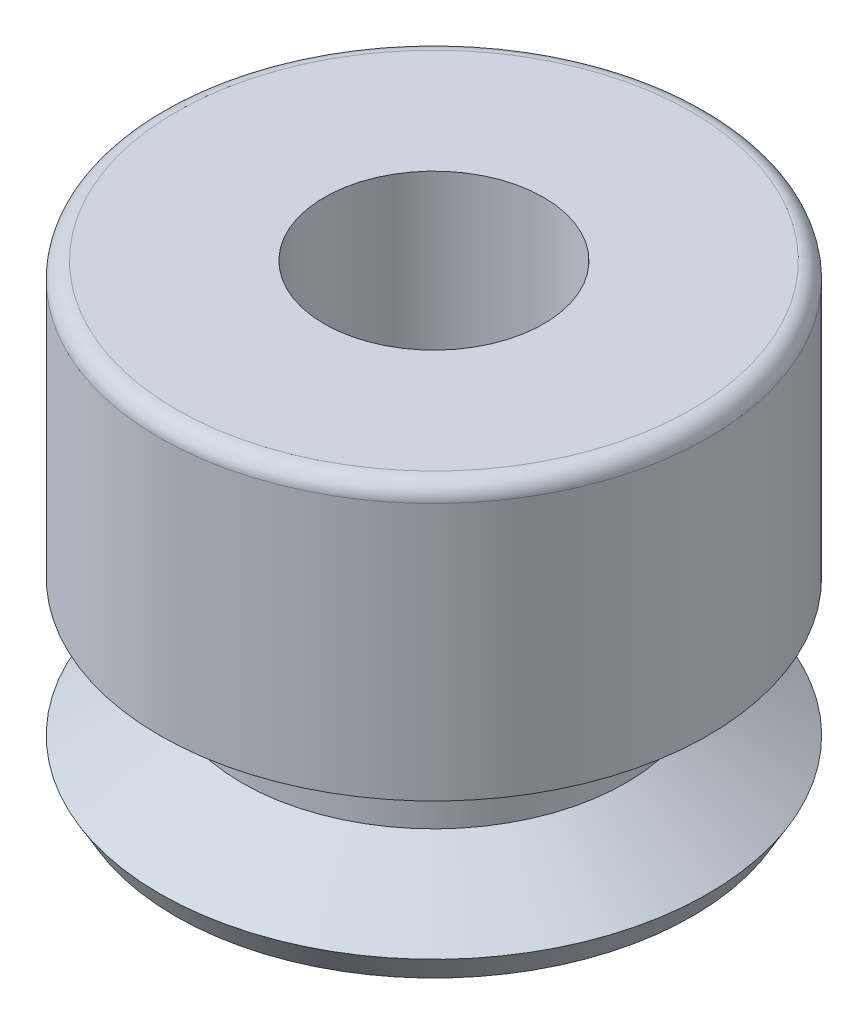
ISO-10303-21;
HEADER;
FILE_DESCRIPTION(('STEP AP214'),'2;1');
FILE_NAME('part.step','',(''),(''),'','','');
FILE_SCHEMA(('AUTOMOTIVE_DESIGN { 1 0 10303 214 1 1 1 1 }'));
ENDSEC;
DATA;
#1=APPLICATION_CONTEXT('core data for automotive mechanical design processes');
#2=APPLICATION_PROTOCOL_DEFINITION('international standard','automotive_design',2000,#1);
#3=PRODUCT_CONTEXT('',#1,'mechanical');
#4=PRODUCT('Part','Part','',(#3));
#5=PRODUCT_RELATED_PRODUCT_CATEGORY('part','',(#4));
#6=PRODUCT_DEFINITION_FORMATION('','',#4);
#7=PRODUCT_DEFINITION_CONTEXT('part definition',#1,'design');
#8=PRODUCT_DEFINITION('design','',#6,#7);
#9=PRODUCT_DEFINITION_SHAPE('','',#8);
#10=(LENGTH_UNIT() NAMED_UNIT(*) SI_UNIT(.MILLI.,.METRE.));
#11=(NAMED_UNIT(*) PLANE_ANGLE_UNIT() SI_UNIT($,.RADIAN.));
#12=(NAMED_UNIT(*) SI_UNIT($,.STERADIAN.) SOLID_ANGLE_UNIT());
#13=UNCERTAINTY_MEASURE_WITH_UNIT(LENGTH_MEASURE(1.E-05),#10,'distance_accuracy_value','');
#14=(GEOMETRIC_REPRESENTATION_CONTEXT(3) GLOBAL_UNCERTAINTY_ASSIGNED_CONTEXT((#13)) GLOBAL_UNIT_ASSIGNED_CONTEXT((#10,
#11,#12)) REPRESENTATION_CONTEXT('',''));
#15=CARTESIAN_POINT('',(0.,0.,0.));
#16=DIRECTION('',(0.,0.,1.));
#17=DIRECTION('',(1.,0.,0.));
#18=AXIS2_PLACEMENT_3D('',#15,#16,#17);
#19=CARTESIAN_POINT('',(0.,8.,0.));
#20=DIRECTION('',(0.,-1.,0.));
#21=DIRECTION('',(0.,0.,-1.));
#22=AXIS2_PLACEMENT_3D('',#19,#20,#21);
#23=PLANE('',#22);
#24=CARTESIAN_POINT('',(0.,8.,0.));
#25=DIRECTION('',(0.,1.,0.));
#26=DIRECTION('',(0.,0.,1.));
#27=AXIS2_PLACEMENT_3D('',#24,#25,#26);
#28=CIRCLE('',#27,4.7);
#29=CARTESIAN_POINT('',(0.,8.,4.7));
#30=VERTEX_POINT('',#29);
#31=EDGE_CURVE('E10',#30,#30,#28,.T.);
#32=ORIENTED_EDGE('',*,*,#31,.T.);
#33=EDGE_LOOP('',(#32));
#34=FACE_BOUND('',#33,.T.);
#35=CARTESIAN_POINT('',(0.,8.,0.));
#36=DIRECTION('',(0.,1.,0.));
#37=DIRECTION('',(0.,0.,1.));
#38=AXIS2_PLACEMENT_3D('',#35,#36,#37);
#39=CIRCLE('',#38,2.);
#40=CARTESIAN_POINT('',(0.,8.,2.));
#41=VERTEX_POINT('',#40);
#42=EDGE_CURVE('E62',#41,#41,#39,.T.);
#43=ORIENTED_EDGE('',*,*,#42,.F.);
#44=EDGE_LOOP('',(#43));
#45=FACE_BOUND('',#44,.T.);
#46=ADVANCED_FACE('F37',(#34,#45),#23,.F.);
#47=CARTESIAN_POINT('',(0.,7.70000000000012,0.));
#48=DIRECTION('',(0.,1.,0.));
#49=DIRECTION('',(0.,0.,1.));
#50=AXIS2_PLACEMENT_3D('',#47,#48,#49);
#51=TOROIDAL_SURFACE('',#50,4.70000000000012,0.299999999999882);
#52=ORIENTED_EDGE('',*,*,#31,.F.);
#53=EDGE_LOOP('',(#52));
#54=FACE_BOUND('',#53,.T.);
#55=CARTESIAN_POINT('',(0.,7.7,0.));
#56=DIRECTION('',(0.,1.,0.));
#57=DIRECTION('',(0.,0.,1.));
#58=AXIS2_PLACEMENT_3D('',#55,#56,#57);
#59=CIRCLE('',#58,5.);
#60=CARTESIAN_POINT('',(0.,7.7,5.));
#61=VERTEX_POINT('',#60);
#62=EDGE_CURVE('E43',#61,#61,#59,.T.);
#63=ORIENTED_EDGE('',*,*,#62,.T.);
#64=EDGE_LOOP('',(#63));
#65=FACE_BOUND('',#64,.T.);
#66=ADVANCED_FACE('F92',(#54,#65),#51,.T.);
#67=CARTESIAN_POINT('',(0.,0.,0.));
#68=DIRECTION('',(0.,1.,0.));
#69=DIRECTION('',(0.,0.,1.));
#70=AXIS2_PLACEMENT_3D('',#67,#68,#69);
#71=CYLINDRICAL_SURFACE('',#70,5.);
#72=ORIENTED_EDGE('',*,*,#62,.F.);
#73=EDGE_LOOP('',(#72));
#74=FACE_BOUND('',#73,.T.);
#75=CARTESIAN_POINT('',(0.,3.,0.));
#76=DIRECTION('',(0.,1.,0.));
#77=DIRECTION('',(0.,0.,1.));
#78=AXIS2_PLACEMENT_3D('',#75,#76,#77);
#79=CIRCLE('',#78,5.);
#80=CARTESIAN_POINT('',(0.,3.,5.));
#81=VERTEX_POINT('',#80);
#82=EDGE_CURVE('E47',#81,#81,#79,.T.);
#83=ORIENTED_EDGE('',*,*,#82,.T.);
#84=EDGE_LOOP('',(#83));
#85=FACE_BOUND('',#84,.T.);
#86=ADVANCED_FACE('F98',(#74,#85),#71,.T.);
#87=CARTESIAN_POINT('',(0.,2.,0.));
#88=DIRECTION('',(0.,1.,0.));
#89=DIRECTION('',(0.,0.,1.));
#90=AXIS2_PLACEMENT_3D('',#87,#88,#89);
#91=CONICAL_SURFACE('',#90,3.5,0.982793723247329);
#92=ORIENTED_EDGE('',*,*,#82,.F.);
#93=EDGE_LOOP('',(#92));
#94=FACE_BOUND('',#93,.T.);
#95=CARTESIAN_POINT('',(0.,2.,0.));
#96=DIRECTION('',(0.,1.,0.));
#97=DIRECTION('',(0.,0.,1.));
#98=AXIS2_PLACEMENT_3D('',#95,#96,#97);
#99=CIRCLE('',#98,3.5);
#100=CARTESIAN_POINT('',(0.,2.,3.5));
#101=VERTEX_POINT('',#100);
#102=EDGE_CURVE('E51',#101,#101,#99,.T.);
#103=ORIENTED_EDGE('',*,*,#102,.T.);
#104=EDGE_LOOP('',(#103));
#105=FACE_BOUND('',#104,.T.);
#106=ADVANCED_FACE('F126',(#94,#105),#91,.T.);
#107=CARTESIAN_POINT('',(0.,0.,0.));
#108=DIRECTION('',(0.,1.,0.));
#109=DIRECTION('',(0.,0.,1.));
#110=AXIS2_PLACEMENT_3D('',#107,#108,#109);
#111=CYLINDRICAL_SURFACE('',#110,3.5);
#112=ORIENTED_EDGE('',*,*,#102,.F.);
#113=EDGE_LOOP('',(#112));
#114=FACE_BOUND('',#113,.T.);
#115=CARTESIAN_POINT('',(0.,1.5,0.));
#116=DIRECTION('',(0.,1.,0.));
#117=DIRECTION('',(0.,0.,1.));
#118=AXIS2_PLACEMENT_3D('',#115,#116,#117);
#119=CIRCLE('',#118,3.5);
#120=CARTESIAN_POINT('',(0.,1.5,3.5));
#121=VERTEX_POINT('',#120);
#122=EDGE_CURVE('E56',#121,#121,#119,.T.);
#123=ORIENTED_EDGE('',*,*,#122,.T.);
#124=EDGE_LOOP('',(#123));
#125=FACE_BOUND('',#124,.T.);
#126=ADVANCED_FACE('F122',(#114,#125),#111,.T.);
#127=CARTESIAN_POINT('',(0.,0.5,0.));
#128=DIRECTION('',(0.,-1.,0.));
#129=DIRECTION('',(0.,0.,-1.));
#130=AXIS2_PLACEMENT_3D('',#127,#128,#129);
#131=CONICAL_SURFACE('',#130,5.,0.982793723247329);
#132=ORIENTED_EDGE('',*,*,#122,.F.);
#133=EDGE_LOOP('',(#132));
#134=FACE_BOUND('',#133,.T.);
#135=CARTESIAN_POINT('',(0.,0.5,0.));
#136=DIRECTION('',(0.,1.,0.));
#137=DIRECTION('',(0.,0.,1.));
#138=AXIS2_PLACEMENT_3D('',#135,#136,#137);
#139=CIRCLE('',#138,5.);
#140=CARTESIAN_POINT('',(0.,0.5,5.));
#141=VERTEX_POINT('',#140);
#142=EDGE_CURVE('E59',#141,#141,#139,.T.);
#143=ORIENTED_EDGE('',*,*,#142,.T.);
#144=EDGE_LOOP('',(#143));
#145=FACE_BOUND('',#144,.T.);
#146=ADVANCED_FACE('F118',(#134,#145),#131,.T.);
#147=CARTESIAN_POINT('',(0.,0.,0.));
#148=DIRECTION('',(0.,1.,0.));
#149=DIRECTION('',(0.,0.,1.));
#150=AXIS2_PLACEMENT_3D('',#147,#148,#149);
#151=CONICAL_SURFACE('',#150,4.7113248654052,0.52359877559828);
#152=ORIENTED_EDGE('',*,*,#142,.F.);
#153=EDGE_LOOP('',(#152));
#154=FACE_BOUND('',#153,.T.);
#155=CARTESIAN_POINT('',(0.,0.,0.));
#156=DIRECTION('',(0.,1.,0.));
#157=DIRECTION('',(0.,0.,1.));
#158=AXIS2_PLACEMENT_3D('',#155,#156,#157);
#159=CIRCLE('',#158,4.7113248654052);
#160=CARTESIAN_POINT('',(0.,0.,4.7113248654052));
#161=VERTEX_POINT('',#160);
#162=EDGE_CURVE('E74',#161,#161,#159,.T.);
#163=ORIENTED_EDGE('',*,*,#162,.T.);
#164=EDGE_LOOP('',(#163));
#165=FACE_BOUND('',#164,.T.);
#166=ADVANCED_FACE('F78',(#154,#165),#151,.T.);
#167=CARTESIAN_POINT('',(0.,0.,0.));
#168=DIRECTION('',(0.,1.,0.));
#169=DIRECTION('',(0.,0.,1.));
#170=AXIS2_PLACEMENT_3D('',#167,#168,#169);
#171=CYLINDRICAL_SURFACE('',#170,2.);
#172=ORIENTED_EDGE('',*,*,#42,.T.);
#173=EDGE_LOOP('',(#172));
#174=FACE_BOUND('',#173,.T.);
#175=CARTESIAN_POINT('',(0.,5.,0.));
#176=DIRECTION('',(0.,1.,0.));
#177=DIRECTION('',(0.,0.,1.));
#178=AXIS2_PLACEMENT_3D('',#175,#176,#177);
#179=CIRCLE('',#178,2.);
#180=CARTESIAN_POINT('',(0.,5.,2.));
#181=VERTEX_POINT('',#180);
#182=EDGE_CURVE('E65',#181,#181,#179,.T.);
#183=ORIENTED_EDGE('',*,*,#182,.F.);
#184=EDGE_LOOP('',(#183));
#185=FACE_BOUND('',#184,.T.);
#186=ADVANCED_FACE('F103',(#174,#185),#171,.F.);
#187=CARTESIAN_POINT('',(2.,5.,0.));
#188=DIRECTION('',(0.,-1.,0.));
#189=DIRECTION('',(0.,0.,-1.));
#190=AXIS2_PLACEMENT_3D('',#187,#188,#189);
#191=PLANE('',#190);
#192=ORIENTED_EDGE('',*,*,#182,.T.);
#193=EDGE_LOOP('',(#192));
#194=FACE_BOUND('',#193,.T.);
#195=CARTESIAN_POINT('',(0.,5.,0.));
#196=DIRECTION('',(0.,1.,0.));
#197=DIRECTION('',(0.,0.,1.));
#198=AXIS2_PLACEMENT_3D('',#195,#196,#197);
#199=CIRCLE('',#198,3.);
#200=CARTESIAN_POINT('',(0.,5.,3.));
#201=VERTEX_POINT('',#200);
#202=EDGE_CURVE('E68',#201,#201,#199,.T.);
#203=ORIENTED_EDGE('',*,*,#202,.F.);
#204=EDGE_LOOP('',(#203));
#205=FACE_BOUND('',#204,.T.);
#206=ADVANCED_FACE('F88',(#194,#205),#191,.T.);
#207=CARTESIAN_POINT('',(0.,0.,0.));
#208=DIRECTION('',(0.,1.,0.));
#209=DIRECTION('',(0.,0.,1.));
#210=AXIS2_PLACEMENT_3D('',#207,#208,#209);
#211=CYLINDRICAL_SURFACE('',#210,3.);
#212=ORIENTED_EDGE('',*,*,#202,.T.);
#213=EDGE_LOOP('',(#212));
#214=FACE_BOUND('',#213,.T.);
#215=CARTESIAN_POINT('',(0.,1.,0.));
#216=DIRECTION('',(0.,1.,0.));
#217=DIRECTION('',(0.,0.,1.));
#218=AXIS2_PLACEMENT_3D('',#215,#216,#217);
#219=CIRCLE('',#218,3.);
#220=CARTESIAN_POINT('',(0.,1.,3.));
#221=VERTEX_POINT('',#220);
#222=EDGE_CURVE('E71',#221,#221,#219,.T.);
#223=ORIENTED_EDGE('',*,*,#222,.F.);
#224=EDGE_LOOP('',(#223));
#225=FACE_BOUND('',#224,.T.);
#226=ADVANCED_FACE('F82',(#214,#225),#211,.F.);
#227=CARTESIAN_POINT('',(0.,0.,0.));
#228=DIRECTION('',(0.,-1.,0.));
#229=DIRECTION('',(0.,0.,-1.));
#230=AXIS2_PLACEMENT_3D('',#227,#228,#229);
#231=CONICAL_SURFACE('',#230,4.7113248654052,1.0419691904424);
#232=ORIENTED_EDGE('',*,*,#222,.T.);
#233=EDGE_LOOP('',(#232));
#234=FACE_BOUND('',#233,.T.);
#235=ORIENTED_EDGE('',*,*,#162,.F.);
#236=EDGE_LOOP('',(#235));
#237=FACE_BOUND('',#236,.T.);
#238=ADVANCED_FACE('F80',(#234,#237),#231,.F.);
#239=CLOSED_SHELL('',(#46,#66,#86,#106,#126,#146,#166,#186,#206,#226,#238));
#240=MANIFOLD_SOLID_BREP('B2',#239);
#241=ADVANCED_BREP_SHAPE_REPRESENTATION('',(#18,#240),#14);
#242=SHAPE_DEFINITION_REPRESENTATION(#9,#241);
ENDSEC;
END-ISO-10303-21;
